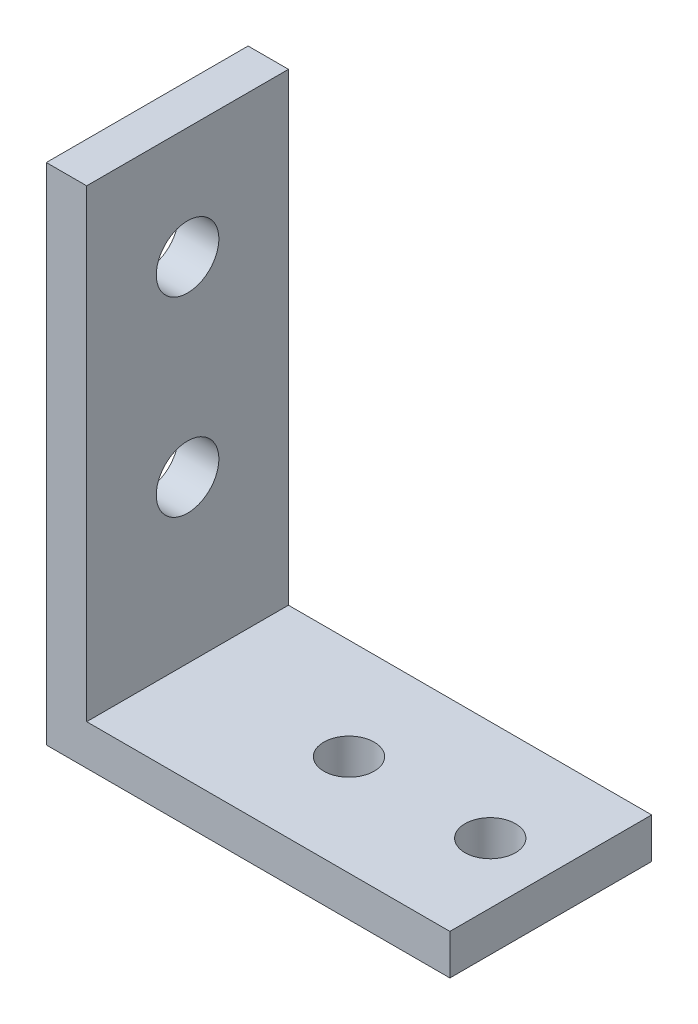
ISO-10303-21;
HEADER;
FILE_DESCRIPTION(('STEP AP214'),'2;1');
FILE_NAME('part.step','',(''),(''),'','','');
FILE_SCHEMA(('AUTOMOTIVE_DESIGN { 1 0 10303 214 1 1 1 1 }'));
ENDSEC;
DATA;
#1=APPLICATION_CONTEXT('core data for automotive mechanical design processes');
#2=APPLICATION_PROTOCOL_DEFINITION('international standard','automotive_design',2000,#1);
#3=PRODUCT_CONTEXT('',#1,'mechanical');
#4=PRODUCT('Part','Part','',(#3));
#5=PRODUCT_RELATED_PRODUCT_CATEGORY('part','',(#4));
#6=PRODUCT_DEFINITION_FORMATION('','',#4);
#7=PRODUCT_DEFINITION_CONTEXT('part definition',#1,'design');
#8=PRODUCT_DEFINITION('design','',#6,#7);
#9=PRODUCT_DEFINITION_SHAPE('','',#8);
#10=(LENGTH_UNIT() NAMED_UNIT(*) SI_UNIT(.MILLI.,.METRE.));
#11=(NAMED_UNIT(*) PLANE_ANGLE_UNIT() SI_UNIT($,.RADIAN.));
#12=(NAMED_UNIT(*) SI_UNIT($,.STERADIAN.) SOLID_ANGLE_UNIT());
#13=UNCERTAINTY_MEASURE_WITH_UNIT(LENGTH_MEASURE(1.E-05),#10,'distance_accuracy_value','');
#14=(GEOMETRIC_REPRESENTATION_CONTEXT(3) GLOBAL_UNCERTAINTY_ASSIGNED_CONTEXT((#13)) GLOBAL_UNIT_ASSIGNED_CONTEXT((#10,
#11,#12)) REPRESENTATION_CONTEXT('',''));
#15=CARTESIAN_POINT('',(0.,0.,0.));
#16=DIRECTION('',(0.,0.,1.));
#17=DIRECTION('',(1.,0.,0.));
#18=AXIS2_PLACEMENT_3D('',#15,#16,#17);
#19=CARTESIAN_POINT('',(20.,0.,5.));
#20=DIRECTION('',(0.,1.,0.));
#21=DIRECTION('',(-1.,0.,0.));
#22=AXIS2_PLACEMENT_3D('',#19,#20,#21);
#23=PLANE('',#22);
#24=CARTESIAN_POINT('',(10.,0.,0.));
#25=DIRECTION('',(0.,-1.,0.));
#26=DIRECTION('',(0.,0.,-1.));
#27=AXIS2_PLACEMENT_3D('',#24,#25,#26);
#28=CIRCLE('',#27,1.24999999999999);
#29=CARTESIAN_POINT('',(10.,0.,-1.24999999999999));
#30=VERTEX_POINT('',#29);
#31=EDGE_CURVE('E168',#30,#30,#28,.T.);
#32=ORIENTED_EDGE('',*,*,#31,.F.);
#33=EDGE_LOOP('',(#32));
#34=FACE_BOUND('',#33,.T.);
#35=DIRECTION('',(1.,0.,0.));
#36=VECTOR('',#35,1.);
#37=CARTESIAN_POINT('',(20.,0.,-4.99999999999999));
#38=LINE('',#37,#36);
#39=CARTESIAN_POINT('',(0.,0.,-4.99999999999999));
#40=VERTEX_POINT('',#39);
#41=CARTESIAN_POINT('',(20.,0.,-4.99999999999999));
#42=VERTEX_POINT('',#41);
#43=EDGE_CURVE('E122',#40,#42,#38,.T.);
#44=ORIENTED_EDGE('',*,*,#43,.T.);
#45=DIRECTION('',(0.,0.,-1.));
#46=VECTOR('',#45,1.);
#47=CARTESIAN_POINT('',(20.,0.,5.));
#48=LINE('',#47,#46);
#49=CARTESIAN_POINT('',(20.,0.,5.));
#50=VERTEX_POINT('',#49);
#51=EDGE_CURVE('E11',#50,#42,#48,.T.);
#52=ORIENTED_EDGE('',*,*,#51,.F.);
#53=DIRECTION('',(1.,0.,0.));
#54=VECTOR('',#53,1.);
#55=CARTESIAN_POINT('',(20.,0.,5.));
#56=LINE('',#55,#54);
#57=CARTESIAN_POINT('',(0.,0.,4.99999999999999));
#58=VERTEX_POINT('',#57);
#59=EDGE_CURVE('E133',#58,#50,#56,.T.);
#60=ORIENTED_EDGE('',*,*,#59,.F.);
#61=DIRECTION('',(0.,0.,-1.));
#62=VECTOR('',#61,1.);
#63=CARTESIAN_POINT('',(0.,0.,4.99999999999999));
#64=LINE('',#63,#62);
#65=EDGE_CURVE('E118',#58,#40,#64,.T.);
#66=ORIENTED_EDGE('',*,*,#65,.T.);
#67=EDGE_LOOP('',(#44,#52,#60,#66));
#68=FACE_BOUND('',#67,.T.);
#69=CARTESIAN_POINT('',(17.,0.,0.));
#70=DIRECTION('',(0.,-1.,0.));
#71=DIRECTION('',(0.,0.,-1.));
#72=AXIS2_PLACEMENT_3D('',#69,#70,#71);
#73=CIRCLE('',#72,1.24999999999999);
#74=CARTESIAN_POINT('',(17.,0.,-1.24999999999999));
#75=VERTEX_POINT('',#74);
#76=EDGE_CURVE('E174',#75,#75,#73,.T.);
#77=ORIENTED_EDGE('',*,*,#76,.F.);
#78=EDGE_LOOP('',(#77));
#79=FACE_BOUND('',#78,.T.);
#80=ADVANCED_FACE('F38',(#34,#68,#79),#23,.F.);
#81=CARTESIAN_POINT('',(20.,2.,5.));
#82=DIRECTION('',(-1.,0.,0.));
#83=DIRECTION('',(0.,0.,1.));
#84=AXIS2_PLACEMENT_3D('',#81,#82,#83);
#85=PLANE('',#84);
#86=DIRECTION('',(0.,1.,0.));
#87=VECTOR('',#86,1.);
#88=CARTESIAN_POINT('',(20.,2.,-4.99999999999999));
#89=LINE('',#88,#87);
#90=CARTESIAN_POINT('',(20.,2.,-4.99999999999999));
#91=VERTEX_POINT('',#90);
#92=EDGE_CURVE('E125',#42,#91,#89,.T.);
#93=ORIENTED_EDGE('',*,*,#92,.T.);
#94=DIRECTION('',(0.,0.,-1.));
#95=VECTOR('',#94,1.);
#96=CARTESIAN_POINT('',(20.,2.,5.));
#97=LINE('',#96,#95);
#98=CARTESIAN_POINT('',(20.,2.,5.));
#99=VERTEX_POINT('',#98);
#100=EDGE_CURVE('E46',#99,#91,#97,.T.);
#101=ORIENTED_EDGE('',*,*,#100,.F.);
#102=DIRECTION('',(0.,1.,0.));
#103=VECTOR('',#102,1.);
#104=CARTESIAN_POINT('',(20.,2.,5.));
#105=LINE('',#104,#103);
#106=EDGE_CURVE('E91',#50,#99,#105,.T.);
#107=ORIENTED_EDGE('',*,*,#106,.F.);
#108=ORIENTED_EDGE('',*,*,#51,.T.);
#109=EDGE_LOOP('',(#93,#101,#107,#108));
#110=FACE_BOUND('',#109,.T.);
#111=ADVANCED_FACE('F161',(#110),#85,.F.);
#112=CARTESIAN_POINT('',(2.,2.00000000000001,4.99999999999999));
#113=DIRECTION('',(0.,-1.,0.));
#114=DIRECTION('',(1.,0.,0.));
#115=AXIS2_PLACEMENT_3D('',#112,#113,#114);
#116=PLANE('',#115);
#117=CARTESIAN_POINT('',(10.,2.00000000000001,0.));
#118=DIRECTION('',(0.,-1.,0.));
#119=DIRECTION('',(1.,0.,0.));
#120=AXIS2_PLACEMENT_3D('',#117,#118,#119);
#121=CIRCLE('',#120,1.24999999999999);
#122=CARTESIAN_POINT('',(11.25,2.00000000000001,0.));
#123=VERTEX_POINT('',#122);
#124=EDGE_CURVE('E170',#123,#123,#121,.T.);
#125=ORIENTED_EDGE('',*,*,#124,.T.);
#126=EDGE_LOOP('',(#125));
#127=FACE_BOUND('',#126,.T.);
#128=CARTESIAN_POINT('',(17.,2.,0.));
#129=DIRECTION('',(0.,-1.,0.));
#130=DIRECTION('',(1.,0.,0.));
#131=AXIS2_PLACEMENT_3D('',#128,#129,#130);
#132=CIRCLE('',#131,1.24999999999999);
#133=CARTESIAN_POINT('',(18.25,2.,0.));
#134=VERTEX_POINT('',#133);
#135=EDGE_CURVE('E126',#134,#134,#132,.T.);
#136=ORIENTED_EDGE('',*,*,#135,.T.);
#137=EDGE_LOOP('',(#136));
#138=FACE_BOUND('',#137,.T.);
#139=DIRECTION('',(-1.,0.,0.));
#140=VECTOR('',#139,1.);
#141=CARTESIAN_POINT('',(2.,2.00000000000002,-5.));
#142=LINE('',#141,#140);
#143=CARTESIAN_POINT('',(2.,2.00000000000002,-5.));
#144=VERTEX_POINT('',#143);
#145=EDGE_CURVE('E128',#91,#144,#142,.T.);
#146=ORIENTED_EDGE('',*,*,#145,.T.);
#147=DIRECTION('',(0.,0.,-1.));
#148=VECTOR('',#147,1.);
#149=CARTESIAN_POINT('',(2.,2.00000000000001,4.99999999999999));
#150=LINE('',#149,#148);
#151=CARTESIAN_POINT('',(2.,2.00000000000001,4.99999999999999));
#152=VERTEX_POINT('',#151);
#153=EDGE_CURVE('E113',#152,#144,#150,.T.);
#154=ORIENTED_EDGE('',*,*,#153,.F.);
#155=DIRECTION('',(-1.,0.,0.));
#156=VECTOR('',#155,1.);
#157=CARTESIAN_POINT('',(2.,2.00000000000001,4.99999999999999));
#158=LINE('',#157,#156);
#159=EDGE_CURVE('E104',#99,#152,#158,.T.);
#160=ORIENTED_EDGE('',*,*,#159,.F.);
#161=ORIENTED_EDGE('',*,*,#100,.T.);
#162=EDGE_LOOP('',(#146,#154,#160,#161));
#163=FACE_BOUND('',#162,.T.);
#164=ADVANCED_FACE('F139',(#127,#138,#163),#116,.F.);
#165=CARTESIAN_POINT('',(2.,25.0000000000001,4.99999999999996));
#166=DIRECTION('',(-1.,0.,0.));
#167=DIRECTION('',(0.,-1.,0.));
#168=AXIS2_PLACEMENT_3D('',#165,#166,#167);
#169=PLANE('',#168);
#170=CARTESIAN_POINT('',(2.,10.,0.));
#171=DIRECTION('',(-1.,0.,0.));
#172=DIRECTION('',(0.,-1.,0.));
#173=AXIS2_PLACEMENT_3D('',#170,#171,#172);
#174=CIRCLE('',#173,1.54999999999999);
#175=CARTESIAN_POINT('',(2.,8.45000000000002,0.));
#176=VERTEX_POINT('',#175);
#177=EDGE_CURVE('E214',#176,#176,#174,.T.);
#178=ORIENTED_EDGE('',*,*,#177,.T.);
#179=EDGE_LOOP('',(#178));
#180=FACE_BOUND('',#179,.T.);
#181=CARTESIAN_POINT('',(1.99999999999988,19.45,0.));
#182=DIRECTION('',(-1.,0.,0.));
#183=DIRECTION('',(0.,-1.,0.));
#184=AXIS2_PLACEMENT_3D('',#181,#182,#183);
#185=CIRCLE('',#184,1.54999999999999);
#186=CARTESIAN_POINT('',(1.99999999999988,17.9,0.));
#187=VERTEX_POINT('',#186);
#188=EDGE_CURVE('E171',#187,#187,#185,.T.);
#189=ORIENTED_EDGE('',*,*,#188,.T.);
#190=EDGE_LOOP('',(#189));
#191=FACE_BOUND('',#190,.T.);
#192=DIRECTION('',(0.,1.,0.));
#193=VECTOR('',#192,1.);
#194=CARTESIAN_POINT('',(2.00000000000002,25.,-5.00000000000005));
#195=LINE('',#194,#193);
#196=CARTESIAN_POINT('',(2.00000000000002,25.,-5.00000000000005));
#197=VERTEX_POINT('',#196);
#198=EDGE_CURVE('E112',#144,#197,#195,.T.);
#199=ORIENTED_EDGE('',*,*,#198,.T.);
#200=DIRECTION('',(0.,0.,-1.));
#201=VECTOR('',#200,1.);
#202=CARTESIAN_POINT('',(2.,25.0000000000001,4.99999999999996));
#203=LINE('',#202,#201);
#204=CARTESIAN_POINT('',(2.,25.0000000000001,4.99999999999996));
#205=VERTEX_POINT('',#204);
#206=EDGE_CURVE('E109',#205,#197,#203,.T.);
#207=ORIENTED_EDGE('',*,*,#206,.F.);
#208=DIRECTION('',(0.,1.,0.));
#209=VECTOR('',#208,1.);
#210=CARTESIAN_POINT('',(2.,25.0000000000001,4.99999999999996));
#211=LINE('',#210,#209);
#212=EDGE_CURVE('E98',#152,#205,#211,.T.);
#213=ORIENTED_EDGE('',*,*,#212,.F.);
#214=ORIENTED_EDGE('',*,*,#153,.T.);
#215=EDGE_LOOP('',(#199,#207,#213,#214));
#216=FACE_BOUND('',#215,.T.);
#217=ADVANCED_FACE('F110',(#180,#191,#216),#169,.F.);
#218=CARTESIAN_POINT('',(0.,25.,5.));
#219=DIRECTION('',(0.,-1.,0.));
#220=DIRECTION('',(0.,0.,-1.));
#221=AXIS2_PLACEMENT_3D('',#218,#219,#220);
#222=PLANE('',#221);
#223=DIRECTION('',(-1.,0.,0.));
#224=VECTOR('',#223,1.);
#225=CARTESIAN_POINT('',(0.,25.,-4.99999999999999));
#226=LINE('',#225,#224);
#227=CARTESIAN_POINT('',(0.,25.,-4.99999999999999));
#228=VERTEX_POINT('',#227);
#229=EDGE_CURVE('E77',#197,#228,#226,.T.);
#230=ORIENTED_EDGE('',*,*,#229,.T.);
#231=DIRECTION('',(0.,0.,-1.));
#232=VECTOR('',#231,1.);
#233=CARTESIAN_POINT('',(0.,25.,5.));
#234=LINE('',#233,#232);
#235=CARTESIAN_POINT('',(0.,25.,5.));
#236=VERTEX_POINT('',#235);
#237=EDGE_CURVE('E114',#236,#228,#234,.T.);
#238=ORIENTED_EDGE('',*,*,#237,.F.);
#239=DIRECTION('',(-1.,0.,0.));
#240=VECTOR('',#239,1.);
#241=CARTESIAN_POINT('',(0.,25.,5.));
#242=LINE('',#241,#240);
#243=EDGE_CURVE('E102',#205,#236,#242,.T.);
#244=ORIENTED_EDGE('',*,*,#243,.F.);
#245=ORIENTED_EDGE('',*,*,#206,.T.);
#246=EDGE_LOOP('',(#230,#238,#244,#245));
#247=FACE_BOUND('',#246,.T.);
#248=ADVANCED_FACE('F116',(#247),#222,.F.);
#249=CARTESIAN_POINT('',(0.,0.,4.99999999999999));
#250=DIRECTION('',(1.,0.,0.));
#251=DIRECTION('',(0.,0.,-1.));
#252=AXIS2_PLACEMENT_3D('',#249,#250,#251);
#253=PLANE('',#252);
#254=CARTESIAN_POINT('',(0.,10.,0.));
#255=DIRECTION('',(-1.,0.,0.));
#256=DIRECTION('',(0.,0.,1.));
#257=AXIS2_PLACEMENT_3D('',#254,#255,#256);
#258=CIRCLE('',#257,1.54999999999999);
#259=CARTESIAN_POINT('',(0.,10.,1.54999999999999));
#260=VERTEX_POINT('',#259);
#261=EDGE_CURVE('E211',#260,#260,#258,.T.);
#262=ORIENTED_EDGE('',*,*,#261,.F.);
#263=EDGE_LOOP('',(#262));
#264=FACE_BOUND('',#263,.T.);
#265=CARTESIAN_POINT('',(-1.17961196366423E-13,19.45,0.));
#266=DIRECTION('',(-1.,0.,0.));
#267=DIRECTION('',(0.,0.,1.));
#268=AXIS2_PLACEMENT_3D('',#265,#266,#267);
#269=CIRCLE('',#268,1.54999999999999);
#270=CARTESIAN_POINT('',(-1.17961196366423E-13,19.45,1.54999999999999));
#271=VERTEX_POINT('',#270);
#272=EDGE_CURVE('E177',#271,#271,#269,.T.);
#273=ORIENTED_EDGE('',*,*,#272,.F.);
#274=EDGE_LOOP('',(#273));
#275=FACE_BOUND('',#274,.T.);
#276=DIRECTION('',(0.,-1.,0.));
#277=VECTOR('',#276,1.);
#278=CARTESIAN_POINT('',(0.,0.,-4.99999999999999));
#279=LINE('',#278,#277);
#280=EDGE_CURVE('E83',#228,#40,#279,.T.);
#281=ORIENTED_EDGE('',*,*,#280,.T.);
#282=ORIENTED_EDGE('',*,*,#65,.F.);
#283=DIRECTION('',(0.,-1.,0.));
#284=VECTOR('',#283,1.);
#285=CARTESIAN_POINT('',(0.,0.,4.99999999999999));
#286=LINE('',#285,#284);
#287=EDGE_CURVE('E54',#236,#58,#286,.T.);
#288=ORIENTED_EDGE('',*,*,#287,.F.);
#289=ORIENTED_EDGE('',*,*,#237,.T.);
#290=EDGE_LOOP('',(#281,#282,#288,#289));
#291=FACE_BOUND('',#290,.T.);
#292=ADVANCED_FACE('F147',(#264,#275,#291),#253,.F.);
#293=CARTESIAN_POINT('',(0.,0.,4.99999999999999));
#294=DIRECTION('',(0.,0.,-1.));
#295=DIRECTION('',(-1.,0.,0.));
#296=AXIS2_PLACEMENT_3D('',#293,#294,#295);
#297=PLANE('',#296);
#298=ORIENTED_EDGE('',*,*,#59,.T.);
#299=ORIENTED_EDGE('',*,*,#106,.T.);
#300=ORIENTED_EDGE('',*,*,#159,.T.);
#301=ORIENTED_EDGE('',*,*,#212,.T.);
#302=ORIENTED_EDGE('',*,*,#243,.T.);
#303=ORIENTED_EDGE('',*,*,#287,.T.);
#304=EDGE_LOOP('',(#298,#299,#300,#301,#302,#303));
#305=FACE_BOUND('',#304,.T.);
#306=ADVANCED_FACE('F100',(#305),#297,.F.);
#307=CARTESIAN_POINT('',(0.,0.,-4.99999999999999));
#308=DIRECTION('',(0.,0.,-1.));
#309=DIRECTION('',(-1.,0.,0.));
#310=AXIS2_PLACEMENT_3D('',#307,#308,#309);
#311=PLANE('',#310);
#312=ORIENTED_EDGE('',*,*,#43,.F.);
#313=ORIENTED_EDGE('',*,*,#280,.F.);
#314=ORIENTED_EDGE('',*,*,#229,.F.);
#315=ORIENTED_EDGE('',*,*,#198,.F.);
#316=ORIENTED_EDGE('',*,*,#145,.F.);
#317=ORIENTED_EDGE('',*,*,#92,.F.);
#318=EDGE_LOOP('',(#312,#313,#314,#315,#316,#317));
#319=FACE_BOUND('',#318,.T.);
#320=ADVANCED_FACE('F142',(#319),#311,.T.);
#321=CARTESIAN_POINT('',(17.,0.,0.));
#322=DIRECTION('',(0.,-1.,0.));
#323=DIRECTION('',(0.,0.,-1.));
#324=AXIS2_PLACEMENT_3D('',#321,#322,#323);
#325=CYLINDRICAL_SURFACE('',#324,1.24999999999999);
#326=ORIENTED_EDGE('',*,*,#76,.T.);
#327=EDGE_LOOP('',(#326));
#328=FACE_BOUND('',#327,.T.);
#329=ORIENTED_EDGE('',*,*,#135,.F.);
#330=EDGE_LOOP('',(#329));
#331=FACE_BOUND('',#330,.T.);
#332=ADVANCED_FACE('F189',(#328,#331),#325,.F.);
#333=CARTESIAN_POINT('',(10.,0.,0.));
#334=DIRECTION('',(0.,-1.,0.));
#335=DIRECTION('',(0.,0.,-1.));
#336=AXIS2_PLACEMENT_3D('',#333,#334,#335);
#337=CYLINDRICAL_SURFACE('',#336,1.24999999999999);
#338=ORIENTED_EDGE('',*,*,#31,.T.);
#339=EDGE_LOOP('',(#338));
#340=FACE_BOUND('',#339,.T.);
#341=ORIENTED_EDGE('',*,*,#124,.F.);
#342=EDGE_LOOP('',(#341));
#343=FACE_BOUND('',#342,.T.);
#344=ADVANCED_FACE('F191',(#340,#343),#337,.F.);
#345=CARTESIAN_POINT('',(-1.11022302462516E-13,19.45,0.));
#346=DIRECTION('',(-1.,0.,0.));
#347=DIRECTION('',(0.,0.,1.));
#348=AXIS2_PLACEMENT_3D('',#345,#346,#347);
#349=CYLINDRICAL_SURFACE('',#348,1.54999999999999);
#350=ORIENTED_EDGE('',*,*,#272,.T.);
#351=EDGE_LOOP('',(#350));
#352=FACE_BOUND('',#351,.T.);
#353=ORIENTED_EDGE('',*,*,#188,.F.);
#354=EDGE_LOOP('',(#353));
#355=FACE_BOUND('',#354,.T.);
#356=ADVANCED_FACE('F198',(#352,#355),#349,.F.);
#357=CARTESIAN_POINT('',(0.,10.,0.));
#358=DIRECTION('',(-1.,0.,0.));
#359=DIRECTION('',(0.,0.,1.));
#360=AXIS2_PLACEMENT_3D('',#357,#358,#359);
#361=CYLINDRICAL_SURFACE('',#360,1.54999999999999);
#362=ORIENTED_EDGE('',*,*,#261,.T.);
#363=EDGE_LOOP('',(#362));
#364=FACE_BOUND('',#363,.T.);
#365=ORIENTED_EDGE('',*,*,#177,.F.);
#366=EDGE_LOOP('',(#365));
#367=FACE_BOUND('',#366,.T.);
#368=ADVANCED_FACE('F203',(#364,#367),#361,.F.);
#369=CLOSED_SHELL('',(#80,#111,#164,#217,#248,#292,#306,#320,#332,#344,#356,#368));
#370=MANIFOLD_SOLID_BREP('B2',#369);
#371=ADVANCED_BREP_SHAPE_REPRESENTATION('',(#18,#370),#14);
#372=SHAPE_DEFINITION_REPRESENTATION(#9,#371);
ENDSEC;
END-ISO-10303-21;
